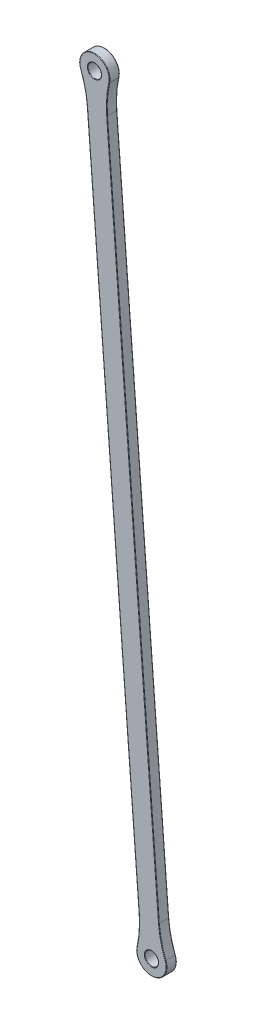
ISO-10303-21;
HEADER;
FILE_DESCRIPTION(('STEP AP214'),'2;1');
FILE_NAME('part.step','',(''),(''),'','','');
FILE_SCHEMA(('AUTOMOTIVE_DESIGN { 1 0 10303 214 1 1 1 1 }'));
ENDSEC;
DATA;
#1=APPLICATION_CONTEXT('core data for automotive mechanical design processes');
#2=APPLICATION_PROTOCOL_DEFINITION('international standard','automotive_design',2000,#1);
#3=PRODUCT_CONTEXT('',#1,'mechanical');
#4=PRODUCT('Part','Part','',(#3));
#5=PRODUCT_RELATED_PRODUCT_CATEGORY('part','',(#4));
#6=PRODUCT_DEFINITION_FORMATION('','',#4);
#7=PRODUCT_DEFINITION_CONTEXT('part definition',#1,'design');
#8=PRODUCT_DEFINITION('design','',#6,#7);
#9=PRODUCT_DEFINITION_SHAPE('','',#8);
#10=(LENGTH_UNIT() NAMED_UNIT(*) SI_UNIT(.MILLI.,.METRE.));
#11=(NAMED_UNIT(*) PLANE_ANGLE_UNIT() SI_UNIT($,.RADIAN.));
#12=(NAMED_UNIT(*) SI_UNIT($,.STERADIAN.) SOLID_ANGLE_UNIT());
#13=UNCERTAINTY_MEASURE_WITH_UNIT(LENGTH_MEASURE(1.E-05),#10,'distance_accuracy_value','');
#14=(GEOMETRIC_REPRESENTATION_CONTEXT(3) GLOBAL_UNCERTAINTY_ASSIGNED_CONTEXT((#13)) GLOBAL_UNIT_ASSIGNED_CONTEXT((#10,
#11,#12)) REPRESENTATION_CONTEXT('',''));
#15=CARTESIAN_POINT('',(0.,0.,0.));
#16=DIRECTION('',(0.,0.,1.));
#17=DIRECTION('',(1.,0.,0.));
#18=AXIS2_PLACEMENT_3D('',#15,#16,#17);
#19=CARTESIAN_POINT('',(23.6446305719539,1.82076954899913,-3.));
#20=DIRECTION('',(-0.99704818829738,-0.0767783186382261,0.));
#21=DIRECTION('',(0.0767783186382261,-0.99704818829738,0.));
#22=AXIS2_PLACEMENT_3D('',#19,#20,#21);
#23=PLANE('',#22);
#24=DIRECTION('',(0.,0.,-1.));
#25=VECTOR('',#24,1.);
#26=CARTESIAN_POINT('',(16.7185776363627,91.7629388223556,-3.));
#27=LINE('',#26,#25);
#28=CARTESIAN_POINT('',(16.7185776363627,91.7629388223556,-0.15));
#29=VERTEX_POINT('',#28);
#30=CARTESIAN_POINT('',(16.7185776363627,91.7629388223556,-2.85));
#31=VERTEX_POINT('',#30);
#32=EDGE_CURVE('E312',#29,#31,#27,.T.);
#33=ORIENTED_EDGE('',*,*,#32,.T.);
#34=DIRECTION('',(0.0767783186382261,-0.99704818829738,0.));
#35=VECTOR('',#34,1.);
#36=CARTESIAN_POINT('',(23.6446305719539,1.82076954899913,-2.85));
#37=LINE('',#36,#35);
#38=CARTESIAN_POINT('',(1.21892475573537,293.04242889149,-2.85));
#39=VERTEX_POINT('',#38);
#40=EDGE_CURVE('E225',#31,#39,#37,.F.);
#41=ORIENTED_EDGE('',*,*,#40,.T.);
#42=DIRECTION('',(0.,0.,1.));
#43=VECTOR('',#42,1.);
#44=CARTESIAN_POINT('',(1.21892475573537,293.04242889149,-3.));
#45=LINE('',#44,#43);
#46=CARTESIAN_POINT('',(1.21892475573537,293.04242889149,-0.15));
#47=VERTEX_POINT('',#46);
#48=EDGE_CURVE('E346',#39,#47,#45,.T.);
#49=ORIENTED_EDGE('',*,*,#48,.T.);
#50=DIRECTION('',(0.0767783186382261,-0.99704818829738,0.));
#51=VECTOR('',#50,1.);
#52=CARTESIAN_POINT('',(16.7185776363627,91.7629388223556,-0.15));
#53=LINE('',#52,#51);
#54=EDGE_CURVE('E223',#47,#29,#53,.T.);
#55=ORIENTED_EDGE('',*,*,#54,.T.);
#56=EDGE_LOOP('',(#33,#41,#49,#55));
#57=FACE_BOUND('',#56,.T.);
#58=ADVANCED_FACE('F39',(#57),#23,.F.);
#59=CARTESIAN_POINT('',(14.5,81.4999999999992,-3.));
#60=DIRECTION('',(0.,0.,1.));
#61=DIRECTION('',(1.,0.,0.));
#62=AXIS2_PLACEMENT_3D('',#59,#60,#61);
#63=CYLINDRICAL_SURFACE('',#62,4.50000000000002);
#64=DIRECTION('',(0.,0.,1.));
#65=VECTOR('',#64,1.);
#66=CARTESIAN_POINT('',(10.1075881988248,82.4781199153966,-3.));
#67=LINE('',#66,#65);
#68=CARTESIAN_POINT('',(10.1075881988248,82.4781199153966,-0.15));
#69=VERTEX_POINT('',#68);
#70=CARTESIAN_POINT('',(10.1075881988248,82.4781199153966,-2.85));
#71=VERTEX_POINT('',#70);
#72=EDGE_CURVE('E343',#69,#71,#67,.F.);
#73=ORIENTED_EDGE('',*,*,#72,.T.);
#74=CARTESIAN_POINT('',(14.5,81.4999999999992,-2.85));
#75=DIRECTION('',(0.,0.,1.));
#76=DIRECTION('',(1.,0.,0.));
#77=AXIS2_PLACEMENT_3D('',#74,#75,#76);
#78=CIRCLE('',#77,4.50000000000002);
#79=CARTESIAN_POINT('',(18.6908726024283,83.1390810932387,-2.85));
#80=VERTEX_POINT('',#79);
#81=EDGE_CURVE('E216',#71,#80,#78,.T.);
#82=ORIENTED_EDGE('',*,*,#81,.T.);
#83=DIRECTION('',(0.,0.,1.));
#84=VECTOR('',#83,1.);
#85=CARTESIAN_POINT('',(18.6908726024283,83.1390810932387,-3.));
#86=LINE('',#85,#84);
#87=CARTESIAN_POINT('',(18.6908726024283,83.1390810932387,-0.15));
#88=VERTEX_POINT('',#87);
#89=EDGE_CURVE('E338',#80,#88,#86,.T.);
#90=ORIENTED_EDGE('',*,*,#89,.T.);
#91=CARTESIAN_POINT('',(14.5,81.4999999999992,-0.15));
#92=DIRECTION('',(0.,0.,1.));
#93=DIRECTION('',(1.,0.,0.));
#94=AXIS2_PLACEMENT_3D('',#91,#92,#93);
#95=CIRCLE('',#94,4.50000000000002);
#96=EDGE_CURVE('E214',#88,#69,#95,.F.);
#97=ORIENTED_EDGE('',*,*,#96,.T.);
#98=EDGE_LOOP('',(#73,#82,#90,#97));
#99=FACE_BOUND('',#98,.T.);
#100=ADVANCED_FACE('F388',(#99),#63,.T.);
#101=CARTESIAN_POINT('',(17.6623414421697,1.36009963716978,-3.));
#102=DIRECTION('',(-0.99704818829738,-0.0767783186382262,0.));
#103=DIRECTION('',(0.0767783186382262,-0.99704818829738,0.));
#104=AXIS2_PLACEMENT_3D('',#101,#102,#103);
#105=PLANE('',#104);
#106=DIRECTION('',(0.,0.,-1.));
#107=VECTOR('',#106,1.);
#108=CARTESIAN_POINT('',(-4.76336437404891,292.581758979661,-3.));
#109=LINE('',#108,#107);
#110=CARTESIAN_POINT('',(-4.76336437404891,292.581758979661,-0.15));
#111=VERTEX_POINT('',#110);
#112=CARTESIAN_POINT('',(-4.76336437404891,292.581758979661,-2.85));
#113=VERTEX_POINT('',#112);
#114=EDGE_CURVE('E268',#111,#113,#109,.T.);
#115=ORIENTED_EDGE('',*,*,#114,.T.);
#116=DIRECTION('',(0.0767783186382262,-0.99704818829738,0.));
#117=VECTOR('',#116,1.);
#118=CARTESIAN_POINT('',(10.7362885065784,91.3022689105265,-2.85));
#119=LINE('',#118,#117);
#120=CARTESIAN_POINT('',(10.7362885065784,91.3022689105265,-2.85));
#121=VERTEX_POINT('',#120);
#122=EDGE_CURVE('E208',#113,#121,#119,.T.);
#123=ORIENTED_EDGE('',*,*,#122,.T.);
#124=DIRECTION('',(0.,0.,1.));
#125=VECTOR('',#124,1.);
#126=CARTESIAN_POINT('',(10.7362885065784,91.3022689105265,-3.));
#127=LINE('',#126,#125);
#128=CARTESIAN_POINT('',(10.7362885065784,91.3022689105265,-0.15));
#129=VERTEX_POINT('',#128);
#130=EDGE_CURVE('E336',#121,#129,#127,.T.);
#131=ORIENTED_EDGE('',*,*,#130,.T.);
#132=DIRECTION('',(0.0767783186382262,-0.99704818829738,0.));
#133=VECTOR('',#132,1.);
#134=CARTESIAN_POINT('',(17.6623414421697,1.36009963716978,-0.15));
#135=LINE('',#134,#133);
#136=EDGE_CURVE('E206',#129,#111,#135,.F.);
#137=ORIENTED_EDGE('',*,*,#136,.T.);
#138=EDGE_LOOP('',(#115,#123,#131,#137));
#139=FACE_BOUND('',#138,.T.);
#140=ADVANCED_FACE('F335',(#139),#105,.T.);
#141=CARTESIAN_POINT('',(14.5,81.4999999999992,-3.));
#142=DIRECTION('',(0.,0.,1.));
#143=DIRECTION('',(1.,0.,0.));
#144=AXIS2_PLACEMENT_3D('',#141,#142,#143);
#145=CYLINDRICAL_SURFACE('',#144,2.);
#146=CARTESIAN_POINT('',(14.5,81.4999999999992,-2.85));
#147=DIRECTION('',(0.,0.,1.));
#148=DIRECTION('',(1.,0.,0.));
#149=AXIS2_PLACEMENT_3D('',#146,#147,#148);
#150=CIRCLE('',#149,2.);
#151=CARTESIAN_POINT('',(16.5,81.4999999999992,-2.85));
#152=VERTEX_POINT('',#151);
#153=EDGE_CURVE('E200',#152,#152,#150,.F.);
#154=ORIENTED_EDGE('',*,*,#153,.T.);
#155=EDGE_LOOP('',(#154));
#156=FACE_BOUND('',#155,.T.);
#157=CARTESIAN_POINT('',(14.5,81.4999999999992,-0.15));
#158=DIRECTION('',(0.,0.,1.));
#159=DIRECTION('',(1.,0.,0.));
#160=AXIS2_PLACEMENT_3D('',#157,#158,#159);
#161=CIRCLE('',#160,2.);
#162=CARTESIAN_POINT('',(16.5,81.4999999999992,-0.15));
#163=VERTEX_POINT('',#162);
#164=EDGE_CURVE('E197',#163,#163,#161,.T.);
#165=ORIENTED_EDGE('',*,*,#164,.T.);
#166=EDGE_LOOP('',(#165));
#167=FACE_BOUND('',#166,.T.);
#168=ADVANCED_FACE('F640',(#156,#167),#145,.F.);
#169=CARTESIAN_POINT('',(-2.54478673768622,302.844697802017,-3.));
#170=DIRECTION('',(0.,0.,1.));
#171=DIRECTION('',(1.,0.,0.));
#172=AXIS2_PLACEMENT_3D('',#169,#170,#171);
#173=CYLINDRICAL_SURFACE('',#172,4.49999999999998);
#174=DIRECTION('',(0.,0.,1.));
#175=VECTOR('',#174,1.);
#176=CARTESIAN_POINT('',(1.84762506348894,301.86657788662,-3.));
#177=LINE('',#176,#175);
#178=CARTESIAN_POINT('',(1.84762506348894,301.86657788662,-0.15));
#179=VERTEX_POINT('',#178);
#180=CARTESIAN_POINT('',(1.84762506348894,301.86657788662,-2.85));
#181=VERTEX_POINT('',#180);
#182=EDGE_CURVE('E310',#179,#181,#177,.F.);
#183=ORIENTED_EDGE('',*,*,#182,.T.);
#184=CARTESIAN_POINT('',(-2.54478673768622,302.844697802017,-2.85));
#185=DIRECTION('',(0.,0.,1.));
#186=DIRECTION('',(1.,0.,0.));
#187=AXIS2_PLACEMENT_3D('',#184,#185,#186);
#188=CIRCLE('',#187,4.49999999999998);
#189=CARTESIAN_POINT('',(-6.73565934011457,301.205616708778,-2.85));
#190=VERTEX_POINT('',#189);
#191=EDGE_CURVE('E233',#181,#190,#188,.T.);
#192=ORIENTED_EDGE('',*,*,#191,.T.);
#193=DIRECTION('',(0.,0.,1.));
#194=VECTOR('',#193,1.);
#195=CARTESIAN_POINT('',(-6.73565934011457,301.205616708778,-3.));
#196=LINE('',#195,#194);
#197=CARTESIAN_POINT('',(-6.73565934011457,301.205616708778,-0.15));
#198=VERTEX_POINT('',#197);
#199=EDGE_CURVE('E174',#190,#198,#196,.T.);
#200=ORIENTED_EDGE('',*,*,#199,.T.);
#201=CARTESIAN_POINT('',(-2.54478673768622,302.844697802017,-0.15));
#202=DIRECTION('',(0.,0.,1.));
#203=DIRECTION('',(1.,0.,0.));
#204=AXIS2_PLACEMENT_3D('',#201,#202,#203);
#205=CIRCLE('',#204,4.49999999999998);
#206=EDGE_CURVE('E231',#198,#179,#205,.F.);
#207=ORIENTED_EDGE('',*,*,#206,.T.);
#208=EDGE_LOOP('',(#183,#192,#200,#207));
#209=FACE_BOUND('',#208,.T.);
#210=ADVANCED_FACE('F308',(#209),#173,.T.);
#211=CARTESIAN_POINT('',(-2.54478673768622,302.844697802017,-3.));
#212=DIRECTION('',(0.,0.,1.));
#213=DIRECTION('',(1.,0.,0.));
#214=AXIS2_PLACEMENT_3D('',#211,#212,#213);
#215=CYLINDRICAL_SURFACE('',#214,2.);
#216=CARTESIAN_POINT('',(-2.54478673768622,302.844697802017,-2.85));
#217=DIRECTION('',(0.,0.,1.));
#218=DIRECTION('',(1.,0.,0.));
#219=AXIS2_PLACEMENT_3D('',#216,#217,#218);
#220=CIRCLE('',#219,2.);
#221=CARTESIAN_POINT('',(-0.544786737686219,302.844697802017,-2.85));
#222=VERTEX_POINT('',#221);
#223=EDGE_CURVE('E194',#222,#222,#220,.F.);
#224=ORIENTED_EDGE('',*,*,#223,.T.);
#225=EDGE_LOOP('',(#224));
#226=FACE_BOUND('',#225,.T.);
#227=CARTESIAN_POINT('',(-2.54478673768622,302.844697802017,-0.15));
#228=DIRECTION('',(0.,0.,1.));
#229=DIRECTION('',(1.,0.,0.));
#230=AXIS2_PLACEMENT_3D('',#227,#228,#229);
#231=CIRCLE('',#230,2.);
#232=CARTESIAN_POINT('',(-0.544786737686219,302.844697802017,-0.15));
#233=VERTEX_POINT('',#232);
#234=EDGE_CURVE('E191',#233,#233,#231,.T.);
#235=ORIENTED_EDGE('',*,*,#234,.T.);
#236=EDGE_LOOP('',(#235));
#237=FACE_BOUND('',#236,.T.);
#238=ADVANCED_FACE('F618',(#226,#237),#215,.F.);
#239=CARTESIAN_POINT('',(0.,0.,-3.));
#240=DIRECTION('',(0.,0.,1.));
#241=DIRECTION('',(1.,0.,0.));
#242=AXIS2_PLACEMENT_3D('',#239,#240,#241);
#243=PLANE('',#242);
#244=CARTESIAN_POINT('',(-2.54478673768622,302.844697802017,-3.));
#245=DIRECTION('',(0.,0.,1.));
#246=DIRECTION('',(1.,0.,0.));
#247=AXIS2_PLACEMENT_3D('',#244,#245,#246);
#248=CIRCLE('',#247,2.15);
#249=CARTESIAN_POINT('',(-0.394786737686219,302.844697802017,-3.));
#250=VERTEX_POINT('',#249);
#251=EDGE_CURVE('E183',#250,#250,#248,.T.);
#252=ORIENTED_EDGE('',*,*,#251,.T.);
#253=EDGE_LOOP('',(#252));
#254=FACE_BOUND('',#253,.T.);
#255=CARTESIAN_POINT('',(14.5,81.4999999999992,-3.));
#256=DIRECTION('',(0.,0.,1.));
#257=DIRECTION('',(1.,0.,0.));
#258=AXIS2_PLACEMENT_3D('',#255,#256,#257);
#259=CIRCLE('',#258,2.15);
#260=CARTESIAN_POINT('',(16.65,81.4999999999992,-3.));
#261=VERTEX_POINT('',#260);
#262=EDGE_CURVE('E180',#261,#261,#259,.T.);
#263=ORIENTED_EDGE('',*,*,#262,.T.);
#264=EDGE_LOOP('',(#263));
#265=FACE_BOUND('',#264,.T.);
#266=DIRECTION('',(0.0767783186382262,-0.99704818829738,0.));
#267=VECTOR('',#266,1.);
#268=CARTESIAN_POINT('',(-4.61380714580431,292.593275727457,-3.));
#269=LINE('',#268,#267);
#270=CARTESIAN_POINT('',(10.885845734823,91.3137856583222,-3.));
#271=VERTEX_POINT('',#270);
#272=CARTESIAN_POINT('',(-4.61380714580431,292.593275727457,-3.));
#273=VERTEX_POINT('',#272);
#274=EDGE_CURVE('E178',#271,#273,#269,.F.);
#275=ORIENTED_EDGE('',*,*,#274,.T.);
#276=CARTESIAN_POINT('',(-34.6748100229703,290.278409420514,-3.));
#277=DIRECTION('',(0.,0.,1.));
#278=DIRECTION('',(1.,0.,0.));
#279=AXIS2_PLACEMENT_3D('',#276,#277,#278);
#280=CIRCLE('',#279,30.15);
#281=CARTESIAN_POINT('',(-6.59596358670028,301.260252745219,-3.));
#282=VERTEX_POINT('',#281);
#283=EDGE_CURVE('E159',#273,#282,#280,.T.);
#284=ORIENTED_EDGE('',*,*,#283,.T.);
#285=CARTESIAN_POINT('',(-2.54478673768622,302.844697802017,-3.));
#286=DIRECTION('',(0.,0.,1.));
#287=DIRECTION('',(1.,0.,0.));
#288=AXIS2_PLACEMENT_3D('',#285,#286,#287);
#289=CIRCLE('',#288,4.34999999999998);
#290=CARTESIAN_POINT('',(1.7012113367831,301.8991818838,-3.));
#291=VERTEX_POINT('',#290);
#292=EDGE_CURVE('E167',#282,#291,#289,.F.);
#293=ORIENTED_EDGE('',*,*,#292,.T.);
#294=CARTESIAN_POINT('',(31.1303704046568,295.345778450637,-3.));
#295=DIRECTION('',(0.,0.,1.));
#296=DIRECTION('',(1.,0.,0.));
#297=AXIS2_PLACEMENT_3D('',#294,#295,#296);
#298=CIRCLE('',#297,30.15);
#299=CARTESIAN_POINT('',(1.06936752749077,293.030912143695,-3.));
#300=VERTEX_POINT('',#299);
#301=EDGE_CURVE('E173',#291,#300,#298,.T.);
#302=ORIENTED_EDGE('',*,*,#301,.T.);
#303=DIRECTION('',(0.0767783186382261,-0.99704818829738,0.));
#304=VECTOR('',#303,1.);
#305=CARTESIAN_POINT('',(23.4950733437093,1.8092528012034,-3.));
#306=LINE('',#305,#304);
#307=CARTESIAN_POINT('',(16.5690204081181,91.7514220745599,-3.));
#308=VERTEX_POINT('',#307);
#309=EDGE_CURVE('E317',#300,#308,#306,.T.);
#310=ORIENTED_EDGE('',*,*,#309,.T.);
#311=CARTESIAN_POINT('',(46.6300232852841,94.0662883815024,-3.));
#312=DIRECTION('',(0.,0.,1.));
#313=DIRECTION('',(1.,0.,0.));
#314=AXIS2_PLACEMENT_3D('',#311,#312,#313);
#315=CIRCLE('',#314,30.15);
#316=CARTESIAN_POINT('',(18.5511768490141,83.0844450567974,-3.));
#317=VERTEX_POINT('',#316);
#318=EDGE_CURVE('E319',#308,#317,#315,.T.);
#319=ORIENTED_EDGE('',*,*,#318,.T.);
#320=CARTESIAN_POINT('',(14.5,81.4999999999992,-3.));
#321=DIRECTION('',(0.,0.,1.));
#322=DIRECTION('',(1.,0.,0.));
#323=AXIS2_PLACEMENT_3D('',#320,#321,#322);
#324=CIRCLE('',#323,4.35000000000002);
#325=CARTESIAN_POINT('',(10.2540019255306,82.4455159182167,-3.));
#326=VERTEX_POINT('',#325);
#327=EDGE_CURVE('E321',#317,#326,#324,.F.);
#328=ORIENTED_EDGE('',*,*,#327,.T.);
#329=CARTESIAN_POINT('',(-19.175157142343,88.9989193513797,-3.));
#330=DIRECTION('',(0.,0.,1.));
#331=DIRECTION('',(1.,0.,0.));
#332=AXIS2_PLACEMENT_3D('',#329,#330,#331);
#333=CIRCLE('',#332,30.15);
#334=EDGE_CURVE('E185',#326,#271,#333,.T.);
#335=ORIENTED_EDGE('',*,*,#334,.T.);
#336=EDGE_LOOP('',(#275,#284,#293,#302,#310,#319,#328,#335));
#337=FACE_BOUND('',#336,.T.);
#338=ADVANCED_FACE('F176',(#254,#265,#337),#243,.F.);
#339=CARTESIAN_POINT('',(0.,0.,0.));
#340=DIRECTION('',(0.,0.,1.));
#341=DIRECTION('',(1.,0.,0.));
#342=AXIS2_PLACEMENT_3D('',#339,#340,#341);
#343=PLANE('',#342);
#344=CARTESIAN_POINT('',(-2.54478673768622,302.844697802017,0.));
#345=DIRECTION('',(0.,0.,1.));
#346=DIRECTION('',(1.,0.,0.));
#347=AXIS2_PLACEMENT_3D('',#344,#345,#346);
#348=CIRCLE('',#347,2.15);
#349=CARTESIAN_POINT('',(-0.394786737686219,302.844697802017,0.));
#350=VERTEX_POINT('',#349);
#351=EDGE_CURVE('E11',#350,#350,#348,.F.);
#352=ORIENTED_EDGE('',*,*,#351,.T.);
#353=EDGE_LOOP('',(#352));
#354=FACE_BOUND('',#353,.T.);
#355=CARTESIAN_POINT('',(14.5,81.4999999999992,0.));
#356=DIRECTION('',(0.,0.,1.));
#357=DIRECTION('',(1.,0.,0.));
#358=AXIS2_PLACEMENT_3D('',#355,#356,#357);
#359=CIRCLE('',#358,2.15);
#360=CARTESIAN_POINT('',(16.65,81.4999999999992,0.));
#361=VERTEX_POINT('',#360);
#362=EDGE_CURVE('E48',#361,#361,#359,.F.);
#363=ORIENTED_EDGE('',*,*,#362,.T.);
#364=EDGE_LOOP('',(#363));
#365=FACE_BOUND('',#364,.T.);
#366=CARTESIAN_POINT('',(14.5,81.4999999999992,0.));
#367=DIRECTION('',(0.,0.,1.));
#368=DIRECTION('',(1.,0.,0.));
#369=AXIS2_PLACEMENT_3D('',#366,#367,#368);
#370=CIRCLE('',#369,4.35000000000002);
#371=CARTESIAN_POINT('',(10.2540019255306,82.4455159182167,0.));
#372=VERTEX_POINT('',#371);
#373=CARTESIAN_POINT('',(18.551176849014,83.0844450567974,0.));
#374=VERTEX_POINT('',#373);
#375=EDGE_CURVE('E56',#372,#374,#370,.T.);
#376=ORIENTED_EDGE('',*,*,#375,.T.);
#377=CARTESIAN_POINT('',(46.6300232852841,94.0662883815024,0.));
#378=DIRECTION('',(0.,0.,1.));
#379=DIRECTION('',(1.,0.,0.));
#380=AXIS2_PLACEMENT_3D('',#377,#378,#379);
#381=CIRCLE('',#380,30.15);
#382=CARTESIAN_POINT('',(16.5690204081181,91.7514220745599,0.));
#383=VERTEX_POINT('',#382);
#384=EDGE_CURVE('E247',#374,#383,#381,.F.);
#385=ORIENTED_EDGE('',*,*,#384,.T.);
#386=DIRECTION('',(0.0767783186382261,-0.99704818829738,0.));
#387=VECTOR('',#386,1.);
#388=CARTESIAN_POINT('',(1.06936752749077,293.030912143695,0.));
#389=LINE('',#388,#387);
#390=CARTESIAN_POINT('',(1.06936752749077,293.030912143695,0.));
#391=VERTEX_POINT('',#390);
#392=EDGE_CURVE('E235',#383,#391,#389,.F.);
#393=ORIENTED_EDGE('',*,*,#392,.T.);
#394=CARTESIAN_POINT('',(31.1303704046568,295.345778450637,0.));
#395=DIRECTION('',(0.,0.,1.));
#396=DIRECTION('',(1.,0.,0.));
#397=AXIS2_PLACEMENT_3D('',#394,#395,#396);
#398=CIRCLE('',#397,30.15);
#399=CARTESIAN_POINT('',(1.70121133678309,301.8991818838,0.));
#400=VERTEX_POINT('',#399);
#401=EDGE_CURVE('E237',#391,#400,#398,.F.);
#402=ORIENTED_EDGE('',*,*,#401,.T.);
#403=CARTESIAN_POINT('',(-2.54478673768622,302.844697802017,0.));
#404=DIRECTION('',(0.,0.,1.));
#405=DIRECTION('',(1.,0.,0.));
#406=AXIS2_PLACEMENT_3D('',#403,#404,#405);
#407=CIRCLE('',#406,4.34999999999998);
#408=CARTESIAN_POINT('',(-6.59596358670028,301.260252745219,0.));
#409=VERTEX_POINT('',#408);
#410=EDGE_CURVE('E239',#400,#409,#407,.T.);
#411=ORIENTED_EDGE('',*,*,#410,.T.);
#412=CARTESIAN_POINT('',(-34.6748100229703,290.278409420514,0.));
#413=DIRECTION('',(0.,0.,1.));
#414=DIRECTION('',(1.,0.,0.));
#415=AXIS2_PLACEMENT_3D('',#412,#413,#414);
#416=CIRCLE('',#415,30.15);
#417=CARTESIAN_POINT('',(-4.61380714580431,292.593275727457,0.));
#418=VERTEX_POINT('',#417);
#419=EDGE_CURVE('E241',#409,#418,#416,.F.);
#420=ORIENTED_EDGE('',*,*,#419,.T.);
#421=DIRECTION('',(0.0767783186382262,-0.99704818829738,0.));
#422=VECTOR('',#421,1.);
#423=CARTESIAN_POINT('',(17.8118986704143,1.37161638496551,0.));
#424=LINE('',#423,#422);
#425=CARTESIAN_POINT('',(10.885845734823,91.3137856583222,0.));
#426=VERTEX_POINT('',#425);
#427=EDGE_CURVE('E243',#418,#426,#424,.T.);
#428=ORIENTED_EDGE('',*,*,#427,.T.);
#429=CARTESIAN_POINT('',(-19.175157142343,88.9989193513797,0.));
#430=DIRECTION('',(0.,0.,1.));
#431=DIRECTION('',(1.,0.,0.));
#432=AXIS2_PLACEMENT_3D('',#429,#430,#431);
#433=CIRCLE('',#432,30.15);
#434=EDGE_CURVE('E61',#426,#372,#433,.F.);
#435=ORIENTED_EDGE('',*,*,#434,.T.);
#436=EDGE_LOOP('',(#376,#385,#393,#402,#411,#420,#428,#435));
#437=FACE_BOUND('',#436,.T.);
#438=ADVANCED_FACE('F414',(#354,#365,#437),#343,.T.);
#439=CARTESIAN_POINT('',(-19.175157142343,88.9989193513797,-3.));
#440=DIRECTION('',(0.,0.,1.));
#441=DIRECTION('',(1.,0.,0.));
#442=AXIS2_PLACEMENT_3D('',#439,#440,#441);
#443=CYLINDRICAL_SURFACE('',#442,30.);
#444=ORIENTED_EDGE('',*,*,#130,.F.);
#445=CARTESIAN_POINT('',(-19.175157142343,88.9989193513797,-2.85));
#446=DIRECTION('',(0.,0.,1.));
#447=DIRECTION('',(1.,0.,0.));
#448=AXIS2_PLACEMENT_3D('',#445,#446,#447);
#449=CIRCLE('',#448,30.);
#450=EDGE_CURVE('E212',#121,#71,#449,.F.);
#451=ORIENTED_EDGE('',*,*,#450,.T.);
#452=ORIENTED_EDGE('',*,*,#72,.F.);
#453=CARTESIAN_POINT('',(-19.175157142343,88.9989193513797,-0.15));
#454=DIRECTION('',(0.,0.,1.));
#455=DIRECTION('',(1.,0.,0.));
#456=AXIS2_PLACEMENT_3D('',#453,#454,#455);
#457=CIRCLE('',#456,30.);
#458=EDGE_CURVE('E210',#69,#129,#457,.T.);
#459=ORIENTED_EDGE('',*,*,#458,.T.);
#460=EDGE_LOOP('',(#444,#451,#452,#459));
#461=FACE_BOUND('',#460,.T.);
#462=ADVANCED_FACE('F411',(#461),#443,.F.);
#463=CARTESIAN_POINT('',(46.6300232852841,94.0662883815024,-3.));
#464=DIRECTION('',(0.,0.,1.));
#465=DIRECTION('',(1.,0.,0.));
#466=AXIS2_PLACEMENT_3D('',#463,#464,#465);
#467=CYLINDRICAL_SURFACE('',#466,30.);
#468=ORIENTED_EDGE('',*,*,#89,.F.);
#469=CARTESIAN_POINT('',(46.6300232852841,94.0662883815024,-2.85));
#470=DIRECTION('',(0.,0.,1.));
#471=DIRECTION('',(1.,0.,0.));
#472=AXIS2_PLACEMENT_3D('',#469,#470,#471);
#473=CIRCLE('',#472,30.);
#474=EDGE_CURVE('E221',#80,#31,#473,.F.);
#475=ORIENTED_EDGE('',*,*,#474,.T.);
#476=ORIENTED_EDGE('',*,*,#32,.F.);
#477=CARTESIAN_POINT('',(46.6300232852841,94.0662883815024,-0.15));
#478=DIRECTION('',(0.,0.,1.));
#479=DIRECTION('',(1.,0.,0.));
#480=AXIS2_PLACEMENT_3D('',#477,#478,#479);
#481=CIRCLE('',#480,30.);
#482=EDGE_CURVE('E218',#29,#88,#481,.T.);
#483=ORIENTED_EDGE('',*,*,#482,.T.);
#484=EDGE_LOOP('',(#468,#475,#476,#483));
#485=FACE_BOUND('',#484,.T.);
#486=ADVANCED_FACE('F386',(#485),#467,.F.);
#487=CARTESIAN_POINT('',(-34.6748100229703,290.278409420514,-3.));
#488=DIRECTION('',(0.,0.,1.));
#489=DIRECTION('',(1.,0.,0.));
#490=AXIS2_PLACEMENT_3D('',#487,#488,#489);
#491=CYLINDRICAL_SURFACE('',#490,30.);
#492=ORIENTED_EDGE('',*,*,#199,.F.);
#493=CARTESIAN_POINT('',(-34.6748100229703,290.278409420514,-2.85));
#494=DIRECTION('',(0.,0.,1.));
#495=DIRECTION('',(1.,0.,0.));
#496=AXIS2_PLACEMENT_3D('',#493,#494,#495);
#497=CIRCLE('',#496,30.);
#498=EDGE_CURVE('E161',#190,#113,#497,.F.);
#499=ORIENTED_EDGE('',*,*,#498,.T.);
#500=ORIENTED_EDGE('',*,*,#114,.F.);
#501=CARTESIAN_POINT('',(-34.6748100229703,290.278409420514,-0.15));
#502=DIRECTION('',(0.,0.,1.));
#503=DIRECTION('',(1.,0.,0.));
#504=AXIS2_PLACEMENT_3D('',#501,#502,#503);
#505=CIRCLE('',#504,30.);
#506=EDGE_CURVE('E203',#111,#198,#505,.T.);
#507=ORIENTED_EDGE('',*,*,#506,.T.);
#508=EDGE_LOOP('',(#492,#499,#500,#507));
#509=FACE_BOUND('',#508,.T.);
#510=ADVANCED_FACE('F304',(#509),#491,.F.);
#511=CARTESIAN_POINT('',(31.1303704046568,295.345778450637,-3.));
#512=DIRECTION('',(0.,0.,1.));
#513=DIRECTION('',(1.,0.,0.));
#514=AXIS2_PLACEMENT_3D('',#511,#512,#513);
#515=CYLINDRICAL_SURFACE('',#514,30.);
#516=ORIENTED_EDGE('',*,*,#48,.F.);
#517=CARTESIAN_POINT('',(31.1303704046568,295.345778450637,-2.85));
#518=DIRECTION('',(0.,0.,1.));
#519=DIRECTION('',(1.,0.,0.));
#520=AXIS2_PLACEMENT_3D('',#517,#518,#519);
#521=CIRCLE('',#520,30.);
#522=EDGE_CURVE('E229',#39,#181,#521,.F.);
#523=ORIENTED_EDGE('',*,*,#522,.T.);
#524=ORIENTED_EDGE('',*,*,#182,.F.);
#525=CARTESIAN_POINT('',(31.1303704046568,295.345778450637,-0.15));
#526=DIRECTION('',(0.,0.,1.));
#527=DIRECTION('',(1.,0.,0.));
#528=AXIS2_PLACEMENT_3D('',#525,#526,#527);
#529=CIRCLE('',#528,30.);
#530=EDGE_CURVE('E227',#179,#47,#529,.T.);
#531=ORIENTED_EDGE('',*,*,#530,.T.);
#532=EDGE_LOOP('',(#516,#523,#524,#531));
#533=FACE_BOUND('',#532,.T.);
#534=ADVANCED_FACE('F370',(#533),#515,.F.);
#535=CARTESIAN_POINT('',(-2.54478673768622,302.844697802017,-2.85));
#536=DIRECTION('',(0.,0.,1.));
#537=DIRECTION('',(1.,0.,0.));
#538=AXIS2_PLACEMENT_3D('',#535,#536,#537);
#539=TOROIDAL_SURFACE('',#538,2.15,0.15);
#540=ORIENTED_EDGE('',*,*,#223,.F.);
#541=EDGE_LOOP('',(#540));
#542=FACE_BOUND('',#541,.T.);
#543=ORIENTED_EDGE('',*,*,#251,.F.);
#544=EDGE_LOOP('',(#543));
#545=FACE_BOUND('',#544,.T.);
#546=ADVANCED_FACE('F422',(#542,#545),#539,.T.);
#547=CARTESIAN_POINT('',(14.5,81.4999999999992,-2.85));
#548=DIRECTION('',(0.,0.,1.));
#549=DIRECTION('',(1.,0.,0.));
#550=AXIS2_PLACEMENT_3D('',#547,#548,#549);
#551=TOROIDAL_SURFACE('',#550,2.15,0.15);
#552=ORIENTED_EDGE('',*,*,#153,.F.);
#553=EDGE_LOOP('',(#552));
#554=FACE_BOUND('',#553,.T.);
#555=ORIENTED_EDGE('',*,*,#262,.F.);
#556=EDGE_LOOP('',(#555));
#557=FACE_BOUND('',#556,.T.);
#558=ADVANCED_FACE('F400',(#554,#557),#551,.T.);
#559=CARTESIAN_POINT('',(46.6300232852841,94.0662883815024,-2.85));
#560=DIRECTION('',(0.,0.,1.));
#561=DIRECTION('',(1.,0.,0.));
#562=AXIS2_PLACEMENT_3D('',#559,#560,#561);
#563=TOROIDAL_SURFACE('',#562,30.15,0.15);
#564=CARTESIAN_POINT('',(16.5690204081181,91.7514220745599,-2.85));
#565=DIRECTION('',(-0.0767783186382089,0.997048188297381,0.));
#566=DIRECTION('',(-0.997048188297381,-0.0767783186382089,0.));
#567=AXIS2_PLACEMENT_3D('',#564,#565,#566);
#568=CIRCLE('',#567,0.15);
#569=EDGE_CURVE('E262',#31,#308,#568,.T.);
#570=ORIENTED_EDGE('',*,*,#569,.F.);
#571=ORIENTED_EDGE('',*,*,#474,.F.);
#572=CARTESIAN_POINT('',(18.5511768490141,83.0844450567974,-2.85));
#573=DIRECTION('',(0.36424024294212,-0.931305022761858,0.));
#574=DIRECTION('',(0.931305022761858,0.36424024294212,0.));
#575=AXIS2_PLACEMENT_3D('',#572,#573,#574);
#576=CIRCLE('',#575,0.15);
#577=EDGE_CURVE('E265',#317,#80,#576,.T.);
#578=ORIENTED_EDGE('',*,*,#577,.F.);
#579=ORIENTED_EDGE('',*,*,#318,.F.);
#580=EDGE_LOOP('',(#570,#571,#578,#579));
#581=FACE_BOUND('',#580,.T.);
#582=ADVANCED_FACE('F360',(#581),#563,.T.);
#583=CARTESIAN_POINT('',(14.5,81.4999999999992,-2.85));
#584=DIRECTION('',(0.,0.,1.));
#585=DIRECTION('',(1.,0.,0.));
#586=AXIS2_PLACEMENT_3D('',#583,#584,#585);
#587=TOROIDAL_SURFACE('',#586,4.35000000000002,0.15);
#588=ORIENTED_EDGE('',*,*,#577,.T.);
#589=ORIENTED_EDGE('',*,*,#81,.F.);
#590=CARTESIAN_POINT('',(10.2540019255306,82.4455159182167,-2.85));
#591=DIRECTION('',(0.217359981199427,0.976091511372261,0.));
#592=DIRECTION('',(-0.976091511372261,0.217359981199427,0.));
#593=AXIS2_PLACEMENT_3D('',#590,#591,#592);
#594=CIRCLE('',#593,0.15);
#595=EDGE_CURVE('E259',#326,#71,#594,.T.);
#596=ORIENTED_EDGE('',*,*,#595,.F.);
#597=ORIENTED_EDGE('',*,*,#327,.F.);
#598=EDGE_LOOP('',(#588,#589,#596,#597));
#599=FACE_BOUND('',#598,.T.);
#600=ADVANCED_FACE('F392',(#599),#587,.T.);
#601=CARTESIAN_POINT('',(23.4950733437093,1.8092528012034,-2.85));
#602=DIRECTION('',(0.0767783186382261,-0.99704818829738,0.));
#603=DIRECTION('',(0.99704818829738,0.0767783186382261,0.));
#604=AXIS2_PLACEMENT_3D('',#601,#602,#603);
#605=CYLINDRICAL_SURFACE('',#604,0.15);
#606=ORIENTED_EDGE('',*,*,#569,.T.);
#607=ORIENTED_EDGE('',*,*,#309,.F.);
#608=CARTESIAN_POINT('',(1.06936752749077,293.030912143695,-2.85));
#609=DIRECTION('',(-0.0767783186383921,0.997048188297367,0.));
#610=DIRECTION('',(-0.997048188297367,-0.0767783186383921,0.));
#611=AXIS2_PLACEMENT_3D('',#608,#609,#610);
#612=CIRCLE('',#611,0.15);
#613=EDGE_CURVE('E256',#39,#300,#612,.T.);
#614=ORIENTED_EDGE('',*,*,#613,.F.);
#615=ORIENTED_EDGE('',*,*,#40,.F.);
#616=EDGE_LOOP('',(#606,#607,#614,#615));
#617=FACE_BOUND('',#616,.T.);
#618=ADVANCED_FACE('F365',(#617),#605,.T.);
#619=CARTESIAN_POINT('',(-19.175157142343,88.9989193513797,-2.85));
#620=DIRECTION('',(0.,0.,1.));
#621=DIRECTION('',(1.,0.,0.));
#622=AXIS2_PLACEMENT_3D('',#619,#620,#621);
#623=TOROIDAL_SURFACE('',#622,30.15,0.15);
#624=ORIENTED_EDGE('',*,*,#595,.T.);
#625=ORIENTED_EDGE('',*,*,#450,.F.);
#626=CARTESIAN_POINT('',(10.885845734823,91.3137856583222,-2.85));
#627=DIRECTION('',(-0.0767783186382071,0.997048188297381,0.));
#628=DIRECTION('',(-0.997048188297381,-0.0767783186382071,0.));
#629=AXIS2_PLACEMENT_3D('',#626,#627,#628);
#630=CIRCLE('',#629,0.15);
#631=EDGE_CURVE('E253',#271,#121,#630,.T.);
#632=ORIENTED_EDGE('',*,*,#631,.F.);
#633=ORIENTED_EDGE('',*,*,#334,.F.);
#634=EDGE_LOOP('',(#624,#625,#632,#633));
#635=FACE_BOUND('',#634,.T.);
#636=ADVANCED_FACE('F328',(#635),#623,.T.);
#637=CARTESIAN_POINT('',(31.1303704046568,295.345778450637,-2.85));
#638=DIRECTION('',(0.,0.,1.));
#639=DIRECTION('',(1.,0.,0.));
#640=AXIS2_PLACEMENT_3D('',#637,#638,#639);
#641=TOROIDAL_SURFACE('',#640,30.15,0.15);
#642=ORIENTED_EDGE('',*,*,#613,.T.);
#643=ORIENTED_EDGE('',*,*,#301,.F.);
#644=CARTESIAN_POINT('',(1.70121133678309,301.8991818838,-2.85));
#645=DIRECTION('',(0.217359981199428,0.976091511372261,0.));
#646=DIRECTION('',(-0.976091511372261,0.217359981199428,0.));
#647=AXIS2_PLACEMENT_3D('',#644,#645,#646);
#648=CIRCLE('',#647,0.15);
#649=EDGE_CURVE('E170',#181,#291,#648,.T.);
#650=ORIENTED_EDGE('',*,*,#649,.F.);
#651=ORIENTED_EDGE('',*,*,#522,.F.);
#652=EDGE_LOOP('',(#642,#643,#650,#651));
#653=FACE_BOUND('',#652,.T.);
#654=ADVANCED_FACE('F368',(#653),#641,.T.);
#655=CARTESIAN_POINT('',(17.8118986704143,1.37161638496551,-2.85));
#656=DIRECTION('',(-0.0767783186382262,0.99704818829738,0.));
#657=DIRECTION('',(-0.99704818829738,-0.0767783186382262,0.));
#658=AXIS2_PLACEMENT_3D('',#655,#656,#657);
#659=CYLINDRICAL_SURFACE('',#658,0.15);
#660=ORIENTED_EDGE('',*,*,#631,.T.);
#661=ORIENTED_EDGE('',*,*,#122,.F.);
#662=CARTESIAN_POINT('',(-4.61380714580431,292.593275727457,-2.85));
#663=DIRECTION('',(-0.0767783186383929,0.997048188297367,0.));
#664=DIRECTION('',(-0.997048188297367,-0.0767783186383929,0.));
#665=AXIS2_PLACEMENT_3D('',#662,#663,#664);
#666=CIRCLE('',#665,0.15);
#667=EDGE_CURVE('E164',#273,#113,#666,.T.);
#668=ORIENTED_EDGE('',*,*,#667,.F.);
#669=ORIENTED_EDGE('',*,*,#274,.F.);
#670=EDGE_LOOP('',(#660,#661,#668,#669));
#671=FACE_BOUND('',#670,.T.);
#672=ADVANCED_FACE('F331',(#671),#659,.T.);
#673=CARTESIAN_POINT('',(-2.54478673768622,302.844697802017,-2.85));
#674=DIRECTION('',(0.,0.,1.));
#675=DIRECTION('',(1.,0.,0.));
#676=AXIS2_PLACEMENT_3D('',#673,#674,#675);
#677=TOROIDAL_SURFACE('',#676,4.34999999999998,0.15);
#678=ORIENTED_EDGE('',*,*,#649,.T.);
#679=ORIENTED_EDGE('',*,*,#292,.F.);
#680=CARTESIAN_POINT('',(-6.59596358670029,301.260252745219,-2.85));
#681=DIRECTION('',(0.364240242941964,-0.931305022761919,0.));
#682=DIRECTION('',(0.93130502276192,0.364240242941964,0.));
#683=AXIS2_PLACEMENT_3D('',#680,#681,#682);
#684=CIRCLE('',#683,0.15);
#685=EDGE_CURVE('E155',#190,#282,#684,.T.);
#686=ORIENTED_EDGE('',*,*,#685,.F.);
#687=ORIENTED_EDGE('',*,*,#191,.F.);
#688=EDGE_LOOP('',(#678,#679,#686,#687));
#689=FACE_BOUND('',#688,.T.);
#690=ADVANCED_FACE('F168',(#689),#677,.T.);
#691=CARTESIAN_POINT('',(-34.6748100229703,290.278409420514,-2.85));
#692=DIRECTION('',(0.,0.,1.));
#693=DIRECTION('',(1.,0.,0.));
#694=AXIS2_PLACEMENT_3D('',#691,#692,#693);
#695=TOROIDAL_SURFACE('',#694,30.15,0.15);
#696=ORIENTED_EDGE('',*,*,#667,.T.);
#697=ORIENTED_EDGE('',*,*,#498,.F.);
#698=ORIENTED_EDGE('',*,*,#685,.T.);
#699=ORIENTED_EDGE('',*,*,#283,.F.);
#700=EDGE_LOOP('',(#696,#697,#698,#699));
#701=FACE_BOUND('',#700,.T.);
#702=ADVANCED_FACE('F157',(#701),#695,.T.);
#703=CARTESIAN_POINT('',(-2.54478673768622,302.844697802017,-0.15));
#704=DIRECTION('',(0.,0.,1.));
#705=DIRECTION('',(1.,0.,0.));
#706=AXIS2_PLACEMENT_3D('',#703,#704,#705);
#707=TOROIDAL_SURFACE('',#706,2.15,0.15);
#708=ORIENTED_EDGE('',*,*,#351,.F.);
#709=EDGE_LOOP('',(#708));
#710=FACE_BOUND('',#709,.T.);
#711=ORIENTED_EDGE('',*,*,#234,.F.);
#712=EDGE_LOOP('',(#711));
#713=FACE_BOUND('',#712,.T.);
#714=ADVANCED_FACE('F431',(#710,#713),#707,.T.);
#715=CARTESIAN_POINT('',(14.5,81.4999999999992,-0.15));
#716=DIRECTION('',(0.,0.,1.));
#717=DIRECTION('',(1.,0.,0.));
#718=AXIS2_PLACEMENT_3D('',#715,#716,#717);
#719=TOROIDAL_SURFACE('',#718,2.15,0.15);
#720=ORIENTED_EDGE('',*,*,#362,.F.);
#721=EDGE_LOOP('',(#720));
#722=FACE_BOUND('',#721,.T.);
#723=ORIENTED_EDGE('',*,*,#164,.F.);
#724=EDGE_LOOP('',(#723));
#725=FACE_BOUND('',#724,.T.);
#726=ADVANCED_FACE('F465',(#722,#725),#719,.T.);
#727=CARTESIAN_POINT('',(-34.6748100229703,290.278409420514,-0.15));
#728=DIRECTION('',(0.,0.,1.));
#729=DIRECTION('',(1.,0.,0.));
#730=AXIS2_PLACEMENT_3D('',#727,#728,#729);
#731=TOROIDAL_SURFACE('',#730,30.15,0.15);
#732=CARTESIAN_POINT('',(-6.59596358670029,301.260252745219,-0.15));
#733=DIRECTION('',(-0.364240242941966,0.931305022761919,0.));
#734=DIRECTION('',(-0.931305022761919,-0.364240242941966,0.));
#735=AXIS2_PLACEMENT_3D('',#732,#733,#734);
#736=CIRCLE('',#735,0.15);
#737=EDGE_CURVE('E284',#198,#409,#736,.T.);
#738=ORIENTED_EDGE('',*,*,#737,.F.);
#739=ORIENTED_EDGE('',*,*,#506,.F.);
#740=CARTESIAN_POINT('',(-4.61380714580431,292.593275727457,-0.15));
#741=DIRECTION('',(0.0767783186383929,-0.997048188297367,0.));
#742=DIRECTION('',(0.997048188297367,0.0767783186383929,0.));
#743=AXIS2_PLACEMENT_3D('',#740,#741,#742);
#744=CIRCLE('',#743,0.15);
#745=EDGE_CURVE('E43',#418,#111,#744,.T.);
#746=ORIENTED_EDGE('',*,*,#745,.F.);
#747=ORIENTED_EDGE('',*,*,#419,.F.);
#748=EDGE_LOOP('',(#738,#739,#746,#747));
#749=FACE_BOUND('',#748,.T.);
#750=ADVANCED_FACE('F41',(#749),#731,.T.);
#751=CARTESIAN_POINT('',(17.8118986704143,1.37161638496551,-0.15));
#752=DIRECTION('',(0.0767783186382262,-0.99704818829738,0.));
#753=DIRECTION('',(0.99704818829738,0.0767783186382262,0.));
#754=AXIS2_PLACEMENT_3D('',#751,#752,#753);
#755=CYLINDRICAL_SURFACE('',#754,0.15);
#756=ORIENTED_EDGE('',*,*,#745,.T.);
#757=ORIENTED_EDGE('',*,*,#136,.F.);
#758=CARTESIAN_POINT('',(10.885845734823,91.3137856583222,-0.15));
#759=DIRECTION('',(0.076778318638208,-0.997048188297381,0.));
#760=DIRECTION('',(0.997048188297381,0.076778318638208,0.));
#761=AXIS2_PLACEMENT_3D('',#758,#759,#760);
#762=CIRCLE('',#761,0.15);
#763=EDGE_CURVE('E282',#426,#129,#762,.T.);
#764=ORIENTED_EDGE('',*,*,#763,.F.);
#765=ORIENTED_EDGE('',*,*,#427,.F.);
#766=EDGE_LOOP('',(#756,#757,#764,#765));
#767=FACE_BOUND('',#766,.T.);
#768=ADVANCED_FACE('F295',(#767),#755,.T.);
#769=CARTESIAN_POINT('',(-2.54478673768622,302.844697802017,-0.15));
#770=DIRECTION('',(0.,0.,1.));
#771=DIRECTION('',(1.,0.,0.));
#772=AXIS2_PLACEMENT_3D('',#769,#770,#771);
#773=TOROIDAL_SURFACE('',#772,4.34999999999998,0.15);
#774=ORIENTED_EDGE('',*,*,#737,.T.);
#775=ORIENTED_EDGE('',*,*,#410,.F.);
#776=CARTESIAN_POINT('',(1.7012113367831,301.8991818838,-0.15));
#777=DIRECTION('',(-0.217359981199428,-0.976091511372261,0.));
#778=DIRECTION('',(0.976091511372261,-0.217359981199428,0.));
#779=AXIS2_PLACEMENT_3D('',#776,#777,#778);
#780=CIRCLE('',#779,0.15);
#781=EDGE_CURVE('E279',#179,#400,#780,.T.);
#782=ORIENTED_EDGE('',*,*,#781,.F.);
#783=ORIENTED_EDGE('',*,*,#206,.F.);
#784=EDGE_LOOP('',(#774,#775,#782,#783));
#785=FACE_BOUND('',#784,.T.);
#786=ADVANCED_FACE('F485',(#785),#773,.T.);
#787=CARTESIAN_POINT('',(-19.175157142343,88.9989193513797,-0.15));
#788=DIRECTION('',(0.,0.,1.));
#789=DIRECTION('',(1.,0.,0.));
#790=AXIS2_PLACEMENT_3D('',#787,#788,#789);
#791=TOROIDAL_SURFACE('',#790,30.15,0.15);
#792=ORIENTED_EDGE('',*,*,#763,.T.);
#793=ORIENTED_EDGE('',*,*,#458,.F.);
#794=CARTESIAN_POINT('',(10.2540019255306,82.4455159182167,-0.15));
#795=DIRECTION('',(-0.217359981199427,-0.976091511372261,0.));
#796=DIRECTION('',(0.976091511372261,-0.217359981199427,0.));
#797=AXIS2_PLACEMENT_3D('',#794,#795,#796);
#798=CIRCLE('',#797,0.15);
#799=EDGE_CURVE('E276',#372,#69,#798,.T.);
#800=ORIENTED_EDGE('',*,*,#799,.F.);
#801=ORIENTED_EDGE('',*,*,#434,.F.);
#802=EDGE_LOOP('',(#792,#793,#800,#801));
#803=FACE_BOUND('',#802,.T.);
#804=ADVANCED_FACE('F491',(#803),#791,.T.);
#805=CARTESIAN_POINT('',(31.1303704046568,295.345778450637,-0.15));
#806=DIRECTION('',(0.,0.,1.));
#807=DIRECTION('',(1.,0.,0.));
#808=AXIS2_PLACEMENT_3D('',#805,#806,#807);
#809=TOROIDAL_SURFACE('',#808,30.15,0.15);
#810=ORIENTED_EDGE('',*,*,#781,.T.);
#811=ORIENTED_EDGE('',*,*,#401,.F.);
#812=CARTESIAN_POINT('',(1.06936752749077,293.030912143695,-0.15));
#813=DIRECTION('',(0.0767783186383921,-0.997048188297367,0.));
#814=DIRECTION('',(0.997048188297367,0.0767783186383921,0.));
#815=AXIS2_PLACEMENT_3D('',#812,#813,#814);
#816=CIRCLE('',#815,0.15);
#817=EDGE_CURVE('E273',#47,#391,#816,.T.);
#818=ORIENTED_EDGE('',*,*,#817,.F.);
#819=ORIENTED_EDGE('',*,*,#530,.F.);
#820=EDGE_LOOP('',(#810,#811,#818,#819));
#821=FACE_BOUND('',#820,.T.);
#822=ADVANCED_FACE('F376',(#821),#809,.T.);
#823=CARTESIAN_POINT('',(14.5,81.4999999999992,-0.15));
#824=DIRECTION('',(0.,0.,1.));
#825=DIRECTION('',(1.,0.,0.));
#826=AXIS2_PLACEMENT_3D('',#823,#824,#825);
#827=TOROIDAL_SURFACE('',#826,4.35000000000002,0.15);
#828=ORIENTED_EDGE('',*,*,#799,.T.);
#829=ORIENTED_EDGE('',*,*,#96,.F.);
#830=CARTESIAN_POINT('',(18.551176849014,83.0844450567974,-0.15));
#831=DIRECTION('',(-0.364240242942128,0.931305022761855,0.));
#832=DIRECTION('',(-0.931305022761855,-0.364240242942128,0.));
#833=AXIS2_PLACEMENT_3D('',#830,#831,#832);
#834=CIRCLE('',#833,0.15);
#835=EDGE_CURVE('E271',#374,#88,#834,.T.);
#836=ORIENTED_EDGE('',*,*,#835,.F.);
#837=ORIENTED_EDGE('',*,*,#375,.F.);
#838=EDGE_LOOP('',(#828,#829,#836,#837));
#839=FACE_BOUND('',#838,.T.);
#840=ADVANCED_FACE('F505',(#839),#827,.T.);
#841=CARTESIAN_POINT('',(23.4950733437093,1.8092528012034,-0.15));
#842=DIRECTION('',(-0.0767783186382261,0.99704818829738,0.));
#843=DIRECTION('',(-0.99704818829738,-0.0767783186382261,0.));
#844=AXIS2_PLACEMENT_3D('',#841,#842,#843);
#845=CYLINDRICAL_SURFACE('',#844,0.15);
#846=ORIENTED_EDGE('',*,*,#817,.T.);
#847=ORIENTED_EDGE('',*,*,#392,.F.);
#848=CARTESIAN_POINT('',(16.5690204081181,91.7514220745599,-0.15));
#849=DIRECTION('',(0.0767783186382089,-0.997048188297381,0.));
#850=DIRECTION('',(0.997048188297381,0.0767783186382089,0.));
#851=AXIS2_PLACEMENT_3D('',#848,#849,#850);
#852=CIRCLE('',#851,0.15);
#853=EDGE_CURVE('E269',#29,#383,#852,.T.);
#854=ORIENTED_EDGE('',*,*,#853,.F.);
#855=ORIENTED_EDGE('',*,*,#54,.F.);
#856=EDGE_LOOP('',(#846,#847,#854,#855));
#857=FACE_BOUND('',#856,.T.);
#858=ADVANCED_FACE('F380',(#857),#845,.T.);
#859=CARTESIAN_POINT('',(46.6300232852841,94.0662883815024,-0.15));
#860=DIRECTION('',(0.,0.,1.));
#861=DIRECTION('',(1.,0.,0.));
#862=AXIS2_PLACEMENT_3D('',#859,#860,#861);
#863=TOROIDAL_SURFACE('',#862,30.15,0.15);
#864=ORIENTED_EDGE('',*,*,#835,.T.);
#865=ORIENTED_EDGE('',*,*,#482,.F.);
#866=ORIENTED_EDGE('',*,*,#853,.T.);
#867=ORIENTED_EDGE('',*,*,#384,.F.);
#868=EDGE_LOOP('',(#864,#865,#866,#867));
#869=FACE_BOUND('',#868,.T.);
#870=ADVANCED_FACE('F383',(#869),#863,.T.);
#871=CLOSED_SHELL('',(#58,#100,#140,#168,#210,#238,#338,#438,#462,#486,#510,#534,#546,#558,#582,
#600,#618,#636,#654,#672,#690,#702,#714,#726,#750,#768,#786,#804,#822,#840,#858,#870));
#872=MANIFOLD_SOLID_BREP('B2',#871);
#873=ADVANCED_BREP_SHAPE_REPRESENTATION('',(#18,#872),#14);
#874=SHAPE_DEFINITION_REPRESENTATION(#9,#873);
ENDSEC;
END-ISO-10303-21;
